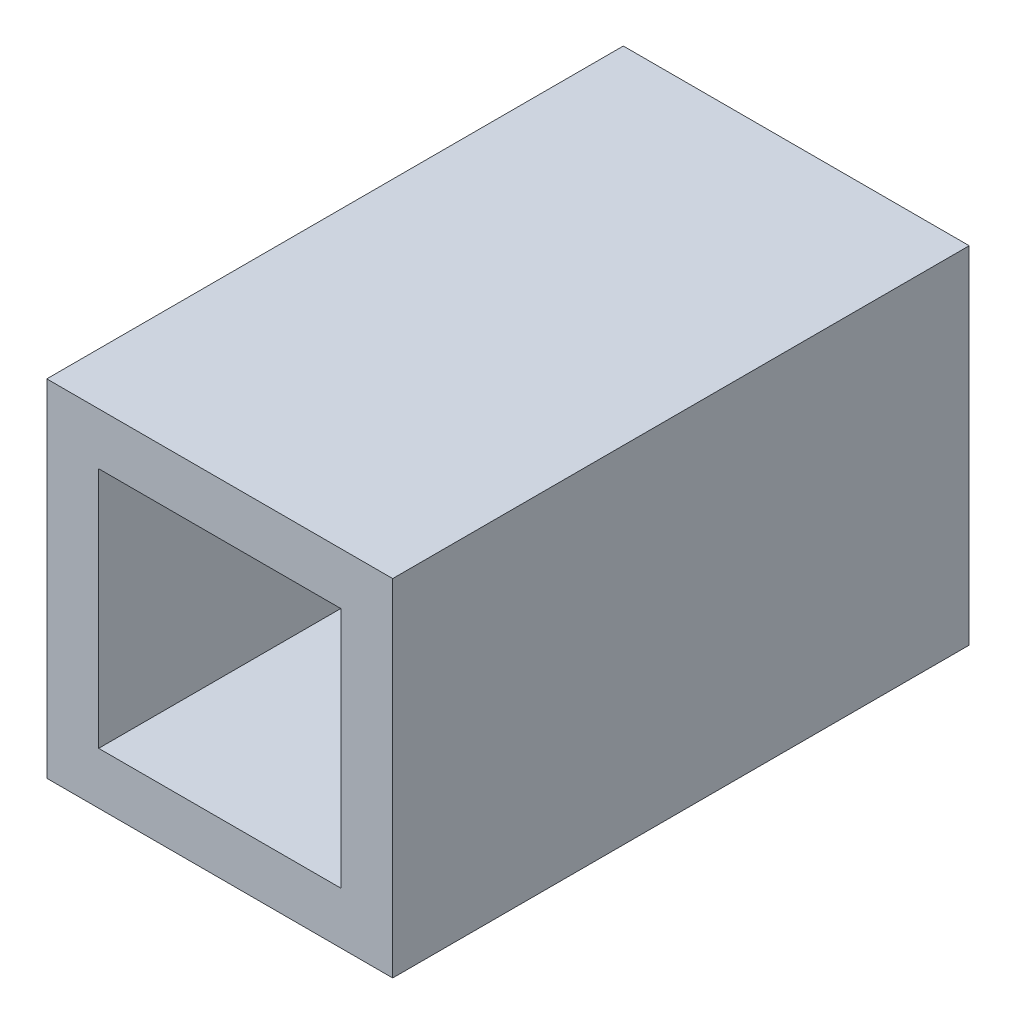
ISO-10303-21;
HEADER;
FILE_DESCRIPTION(('STEP AP214'),'2;1');
FILE_NAME('part.step','',(''),(''),'','','');
FILE_SCHEMA(('AUTOMOTIVE_DESIGN { 1 0 10303 214 1 1 1 1 }'));
ENDSEC;
DATA;
#1=APPLICATION_CONTEXT('core data for automotive mechanical design processes');
#2=APPLICATION_PROTOCOL_DEFINITION('international standard','automotive_design',2000,#1);
#3=PRODUCT_CONTEXT('',#1,'mechanical');
#4=PRODUCT('Part','Part','',(#3));
#5=PRODUCT_RELATED_PRODUCT_CATEGORY('part','',(#4));
#6=PRODUCT_DEFINITION_FORMATION('','',#4);
#7=PRODUCT_DEFINITION_CONTEXT('part definition',#1,'design');
#8=PRODUCT_DEFINITION('design','',#6,#7);
#9=PRODUCT_DEFINITION_SHAPE('','',#8);
#10=(LENGTH_UNIT() NAMED_UNIT(*) SI_UNIT(.MILLI.,.METRE.));
#11=(NAMED_UNIT(*) PLANE_ANGLE_UNIT() SI_UNIT($,.RADIAN.));
#12=(NAMED_UNIT(*) SI_UNIT($,.STERADIAN.) SOLID_ANGLE_UNIT());
#13=UNCERTAINTY_MEASURE_WITH_UNIT(LENGTH_MEASURE(1.E-05),#10,'distance_accuracy_value','');
#14=(GEOMETRIC_REPRESENTATION_CONTEXT(3) GLOBAL_UNCERTAINTY_ASSIGNED_CONTEXT((#13)) GLOBAL_UNIT_ASSIGNED_CONTEXT((#10,
#11,#12)) REPRESENTATION_CONTEXT('',''));
#15=CARTESIAN_POINT('',(0.,0.,0.));
#16=DIRECTION('',(0.,0.,1.));
#17=DIRECTION('',(1.,0.,0.));
#18=AXIS2_PLACEMENT_3D('',#15,#16,#17);
#19=CARTESIAN_POINT('',(0.,0.,10.));
#20=DIRECTION('',(0.,0.,-1.));
#21=DIRECTION('',(-1.,0.,0.));
#22=AXIS2_PLACEMENT_3D('',#19,#20,#21);
#23=PLANE('',#22);
#24=DIRECTION('',(0.,1.,0.));
#25=VECTOR('',#24,1.);
#26=CARTESIAN_POINT('',(5.1,5.1,10.));
#27=LINE('',#26,#25);
#28=CARTESIAN_POINT('',(5.1,-0.9,10.));
#29=VERTEX_POINT('',#28);
#30=CARTESIAN_POINT('',(5.1,5.1,10.));
#31=VERTEX_POINT('',#30);
#32=EDGE_CURVE('E136',#29,#31,#27,.T.);
#33=ORIENTED_EDGE('',*,*,#32,.T.);
#34=DIRECTION('',(-1.,0.,0.));
#35=VECTOR('',#34,1.);
#36=CARTESIAN_POINT('',(5.1,5.1,10.));
#37=LINE('',#36,#35);
#38=CARTESIAN_POINT('',(-0.9,5.1,10.));
#39=VERTEX_POINT('',#38);
#40=EDGE_CURVE('E139',#31,#39,#37,.T.);
#41=ORIENTED_EDGE('',*,*,#40,.T.);
#42=DIRECTION('',(0.,-1.,0.));
#43=VECTOR('',#42,1.);
#44=CARTESIAN_POINT('',(-0.9,5.1,10.));
#45=LINE('',#44,#43);
#46=CARTESIAN_POINT('',(-0.900000000000001,-0.9,10.));
#47=VERTEX_POINT('',#46);
#48=EDGE_CURVE('E142',#39,#47,#45,.T.);
#49=ORIENTED_EDGE('',*,*,#48,.T.);
#50=DIRECTION('',(1.,0.,0.));
#51=VECTOR('',#50,1.);
#52=CARTESIAN_POINT('',(5.1,-0.9,10.));
#53=LINE('',#52,#51);
#54=EDGE_CURVE('E144',#47,#29,#53,.T.);
#55=ORIENTED_EDGE('',*,*,#54,.T.);
#56=EDGE_LOOP('',(#33,#41,#49,#55));
#57=FACE_BOUND('',#56,.T.);
#58=DIRECTION('',(0.,-1.,0.));
#59=VECTOR('',#58,1.);
#60=CARTESIAN_POINT('',(0.,0.,10.));
#61=LINE('',#60,#59);
#62=CARTESIAN_POINT('',(0.,4.2,10.));
#63=VERTEX_POINT('',#62);
#64=CARTESIAN_POINT('',(0.,0.,10.));
#65=VERTEX_POINT('',#64);
#66=EDGE_CURVE('E100',#63,#65,#61,.T.);
#67=ORIENTED_EDGE('',*,*,#66,.F.);
#68=DIRECTION('',(-1.,0.,0.));
#69=VECTOR('',#68,1.);
#70=CARTESIAN_POINT('',(0.,4.2,10.));
#71=LINE('',#70,#69);
#72=CARTESIAN_POINT('',(4.2,4.2,10.));
#73=VERTEX_POINT('',#72);
#74=EDGE_CURVE('E122',#73,#63,#71,.T.);
#75=ORIENTED_EDGE('',*,*,#74,.F.);
#76=DIRECTION('',(0.,1.,0.));
#77=VECTOR('',#76,1.);
#78=CARTESIAN_POINT('',(4.2,0.,10.));
#79=LINE('',#78,#77);
#80=CARTESIAN_POINT('',(4.2,0.,10.));
#81=VERTEX_POINT('',#80);
#82=EDGE_CURVE('E120',#81,#73,#79,.T.);
#83=ORIENTED_EDGE('',*,*,#82,.F.);
#84=DIRECTION('',(1.,0.,0.));
#85=VECTOR('',#84,1.);
#86=CARTESIAN_POINT('',(0.,0.,10.));
#87=LINE('',#86,#85);
#88=EDGE_CURVE('E108',#65,#81,#87,.T.);
#89=ORIENTED_EDGE('',*,*,#88,.F.);
#90=EDGE_LOOP('',(#67,#75,#83,#89));
#91=FACE_BOUND('',#90,.T.);
#92=ADVANCED_FACE('F35',(#57,#91),#23,.F.);
#93=CARTESIAN_POINT('',(0.,0.,0.));
#94=DIRECTION('',(0.,0.,-1.));
#95=DIRECTION('',(-1.,0.,0.));
#96=AXIS2_PLACEMENT_3D('',#93,#94,#95);
#97=PLANE('',#96);
#98=DIRECTION('',(0.,1.,0.));
#99=VECTOR('',#98,1.);
#100=CARTESIAN_POINT('',(5.1,5.1,0.));
#101=LINE('',#100,#99);
#102=CARTESIAN_POINT('',(5.1,-0.9,0.));
#103=VERTEX_POINT('',#102);
#104=CARTESIAN_POINT('',(5.1,5.1,0.));
#105=VERTEX_POINT('',#104);
#106=EDGE_CURVE('E116',#103,#105,#101,.T.);
#107=ORIENTED_EDGE('',*,*,#106,.F.);
#108=DIRECTION('',(1.,0.,0.));
#109=VECTOR('',#108,1.);
#110=CARTESIAN_POINT('',(5.1,-0.9,0.));
#111=LINE('',#110,#109);
#112=CARTESIAN_POINT('',(-0.900000000000001,-0.9,0.));
#113=VERTEX_POINT('',#112);
#114=EDGE_CURVE('E140',#113,#103,#111,.T.);
#115=ORIENTED_EDGE('',*,*,#114,.F.);
#116=DIRECTION('',(0.,-1.,0.));
#117=VECTOR('',#116,1.);
#118=CARTESIAN_POINT('',(-0.9,5.1,0.));
#119=LINE('',#118,#117);
#120=CARTESIAN_POINT('',(-0.9,5.1,0.));
#121=VERTEX_POINT('',#120);
#122=EDGE_CURVE('E151',#121,#113,#119,.T.);
#123=ORIENTED_EDGE('',*,*,#122,.F.);
#124=DIRECTION('',(-1.,0.,0.));
#125=VECTOR('',#124,1.);
#126=CARTESIAN_POINT('',(5.1,5.1,0.));
#127=LINE('',#126,#125);
#128=EDGE_CURVE('E149',#105,#121,#127,.T.);
#129=ORIENTED_EDGE('',*,*,#128,.F.);
#130=EDGE_LOOP('',(#107,#115,#123,#129));
#131=FACE_BOUND('',#130,.T.);
#132=DIRECTION('',(-1.,0.,0.));
#133=VECTOR('',#132,1.);
#134=CARTESIAN_POINT('',(0.,4.2,0.));
#135=LINE('',#134,#133);
#136=CARTESIAN_POINT('',(4.2,4.2,0.));
#137=VERTEX_POINT('',#136);
#138=CARTESIAN_POINT('',(0.,4.2,0.));
#139=VERTEX_POINT('',#138);
#140=EDGE_CURVE('E109',#137,#139,#135,.T.);
#141=ORIENTED_EDGE('',*,*,#140,.T.);
#142=DIRECTION('',(0.,-1.,0.));
#143=VECTOR('',#142,1.);
#144=CARTESIAN_POINT('',(0.,0.,0.));
#145=LINE('',#144,#143);
#146=CARTESIAN_POINT('',(0.,0.,0.));
#147=VERTEX_POINT('',#146);
#148=EDGE_CURVE('E58',#139,#147,#145,.T.);
#149=ORIENTED_EDGE('',*,*,#148,.T.);
#150=DIRECTION('',(1.,0.,0.));
#151=VECTOR('',#150,1.);
#152=CARTESIAN_POINT('',(0.,0.,0.));
#153=LINE('',#152,#151);
#154=CARTESIAN_POINT('',(4.2,0.,0.));
#155=VERTEX_POINT('',#154);
#156=EDGE_CURVE('E115',#147,#155,#153,.T.);
#157=ORIENTED_EDGE('',*,*,#156,.T.);
#158=DIRECTION('',(0.,1.,0.));
#159=VECTOR('',#158,1.);
#160=CARTESIAN_POINT('',(4.2,0.,0.));
#161=LINE('',#160,#159);
#162=EDGE_CURVE('E128',#155,#137,#161,.T.);
#163=ORIENTED_EDGE('',*,*,#162,.T.);
#164=EDGE_LOOP('',(#141,#149,#157,#163));
#165=FACE_BOUND('',#164,.T.);
#166=ADVANCED_FACE('F169',(#131,#165),#97,.T.);
#167=CARTESIAN_POINT('',(5.1,5.1,10.));
#168=DIRECTION('',(-1.,0.,0.));
#169=DIRECTION('',(0.,-1.,0.));
#170=AXIS2_PLACEMENT_3D('',#167,#168,#169);
#171=PLANE('',#170);
#172=ORIENTED_EDGE('',*,*,#106,.T.);
#173=DIRECTION('',(0.,0.,-1.));
#174=VECTOR('',#173,1.);
#175=CARTESIAN_POINT('',(5.1,5.1,10.));
#176=LINE('',#175,#174);
#177=EDGE_CURVE('E11',#31,#105,#176,.T.);
#178=ORIENTED_EDGE('',*,*,#177,.F.);
#179=ORIENTED_EDGE('',*,*,#32,.F.);
#180=DIRECTION('',(0.,0.,-1.));
#181=VECTOR('',#180,1.);
#182=CARTESIAN_POINT('',(5.1,-0.9,10.));
#183=LINE('',#182,#181);
#184=EDGE_CURVE('E146',#29,#103,#183,.T.);
#185=ORIENTED_EDGE('',*,*,#184,.T.);
#186=EDGE_LOOP('',(#172,#178,#179,#185));
#187=FACE_BOUND('',#186,.T.);
#188=ADVANCED_FACE('F37',(#187),#171,.F.);
#189=CARTESIAN_POINT('',(5.1,5.1,10.));
#190=DIRECTION('',(0.,-1.,0.));
#191=DIRECTION('',(0.,0.,-1.));
#192=AXIS2_PLACEMENT_3D('',#189,#190,#191);
#193=PLANE('',#192);
#194=ORIENTED_EDGE('',*,*,#128,.T.);
#195=DIRECTION('',(0.,0.,-1.));
#196=VECTOR('',#195,1.);
#197=CARTESIAN_POINT('',(-0.9,5.1,10.));
#198=LINE('',#197,#196);
#199=EDGE_CURVE('E43',#39,#121,#198,.T.);
#200=ORIENTED_EDGE('',*,*,#199,.F.);
#201=ORIENTED_EDGE('',*,*,#40,.F.);
#202=ORIENTED_EDGE('',*,*,#177,.T.);
#203=EDGE_LOOP('',(#194,#200,#201,#202));
#204=FACE_BOUND('',#203,.T.);
#205=ADVANCED_FACE('F179',(#204),#193,.F.);
#206=CARTESIAN_POINT('',(-0.9,5.1,10.));
#207=DIRECTION('',(1.,0.,0.));
#208=DIRECTION('',(0.,1.,0.));
#209=AXIS2_PLACEMENT_3D('',#206,#207,#208);
#210=PLANE('',#209);
#211=ORIENTED_EDGE('',*,*,#122,.T.);
#212=DIRECTION('',(0.,0.,-1.));
#213=VECTOR('',#212,1.);
#214=CARTESIAN_POINT('',(-0.900000000000001,-0.9,10.));
#215=LINE('',#214,#213);
#216=EDGE_CURVE('E156',#47,#113,#215,.T.);
#217=ORIENTED_EDGE('',*,*,#216,.F.);
#218=ORIENTED_EDGE('',*,*,#48,.F.);
#219=ORIENTED_EDGE('',*,*,#199,.T.);
#220=EDGE_LOOP('',(#211,#217,#218,#219));
#221=FACE_BOUND('',#220,.T.);
#222=ADVANCED_FACE('F163',(#221),#210,.F.);
#223=CARTESIAN_POINT('',(5.1,-0.9,10.));
#224=DIRECTION('',(0.,1.,0.));
#225=DIRECTION('',(0.,0.,1.));
#226=AXIS2_PLACEMENT_3D('',#223,#224,#225);
#227=PLANE('',#226);
#228=ORIENTED_EDGE('',*,*,#114,.T.);
#229=ORIENTED_EDGE('',*,*,#184,.F.);
#230=ORIENTED_EDGE('',*,*,#54,.F.);
#231=ORIENTED_EDGE('',*,*,#216,.T.);
#232=EDGE_LOOP('',(#228,#229,#230,#231));
#233=FACE_BOUND('',#232,.T.);
#234=ADVANCED_FACE('F173',(#233),#227,.F.);
#235=CARTESIAN_POINT('',(0.,0.,10.));
#236=DIRECTION('',(1.,0.,0.));
#237=DIRECTION('',(0.,0.,-1.));
#238=AXIS2_PLACEMENT_3D('',#235,#236,#237);
#239=PLANE('',#238);
#240=ORIENTED_EDGE('',*,*,#148,.F.);
#241=DIRECTION('',(0.,0.,-1.));
#242=VECTOR('',#241,1.);
#243=CARTESIAN_POINT('',(0.,4.2,10.));
#244=LINE('',#243,#242);
#245=EDGE_CURVE('E104',#63,#139,#244,.T.);
#246=ORIENTED_EDGE('',*,*,#245,.F.);
#247=ORIENTED_EDGE('',*,*,#66,.T.);
#248=DIRECTION('',(0.,0.,-1.));
#249=VECTOR('',#248,1.);
#250=CARTESIAN_POINT('',(0.,0.,10.));
#251=LINE('',#250,#249);
#252=EDGE_CURVE('E103',#65,#147,#251,.T.);
#253=ORIENTED_EDGE('',*,*,#252,.T.);
#254=EDGE_LOOP('',(#240,#246,#247,#253));
#255=FACE_BOUND('',#254,.T.);
#256=ADVANCED_FACE('F102',(#255),#239,.T.);
#257=CARTESIAN_POINT('',(0.,0.,10.));
#258=DIRECTION('',(0.,1.,0.));
#259=DIRECTION('',(0.,0.,1.));
#260=AXIS2_PLACEMENT_3D('',#257,#258,#259);
#261=PLANE('',#260);
#262=ORIENTED_EDGE('',*,*,#156,.F.);
#263=ORIENTED_EDGE('',*,*,#252,.F.);
#264=ORIENTED_EDGE('',*,*,#88,.T.);
#265=DIRECTION('',(0.,0.,-1.));
#266=VECTOR('',#265,1.);
#267=CARTESIAN_POINT('',(4.2,0.,10.));
#268=LINE('',#267,#266);
#269=EDGE_CURVE('E117',#81,#155,#268,.T.);
#270=ORIENTED_EDGE('',*,*,#269,.T.);
#271=EDGE_LOOP('',(#262,#263,#264,#270));
#272=FACE_BOUND('',#271,.T.);
#273=ADVANCED_FACE('F112',(#272),#261,.T.);
#274=CARTESIAN_POINT('',(4.2,0.,10.));
#275=DIRECTION('',(-1.,0.,0.));
#276=DIRECTION('',(0.,0.,1.));
#277=AXIS2_PLACEMENT_3D('',#274,#275,#276);
#278=PLANE('',#277);
#279=ORIENTED_EDGE('',*,*,#162,.F.);
#280=ORIENTED_EDGE('',*,*,#269,.F.);
#281=ORIENTED_EDGE('',*,*,#82,.T.);
#282=DIRECTION('',(0.,0.,-1.));
#283=VECTOR('',#282,1.);
#284=CARTESIAN_POINT('',(4.2,4.2,10.));
#285=LINE('',#284,#283);
#286=EDGE_CURVE('E50',#73,#137,#285,.T.);
#287=ORIENTED_EDGE('',*,*,#286,.T.);
#288=EDGE_LOOP('',(#279,#280,#281,#287));
#289=FACE_BOUND('',#288,.T.);
#290=ADVANCED_FACE('F202',(#289),#278,.T.);
#291=CARTESIAN_POINT('',(0.,4.2,10.));
#292=DIRECTION('',(0.,-1.,0.));
#293=DIRECTION('',(0.,0.,-1.));
#294=AXIS2_PLACEMENT_3D('',#291,#292,#293);
#295=PLANE('',#294);
#296=ORIENTED_EDGE('',*,*,#140,.F.);
#297=ORIENTED_EDGE('',*,*,#286,.F.);
#298=ORIENTED_EDGE('',*,*,#74,.T.);
#299=ORIENTED_EDGE('',*,*,#245,.T.);
#300=EDGE_LOOP('',(#296,#297,#298,#299));
#301=FACE_BOUND('',#300,.T.);
#302=ADVANCED_FACE('F206',(#301),#295,.T.);
#303=CLOSED_SHELL('',(#92,#166,#188,#205,#222,#234,#256,#273,#290,#302));
#304=MANIFOLD_SOLID_BREP('B2',#303);
#305=ADVANCED_BREP_SHAPE_REPRESENTATION('',(#18,#304),#14);
#306=SHAPE_DEFINITION_REPRESENTATION(#9,#305);
ENDSEC;
END-ISO-10303-21;
